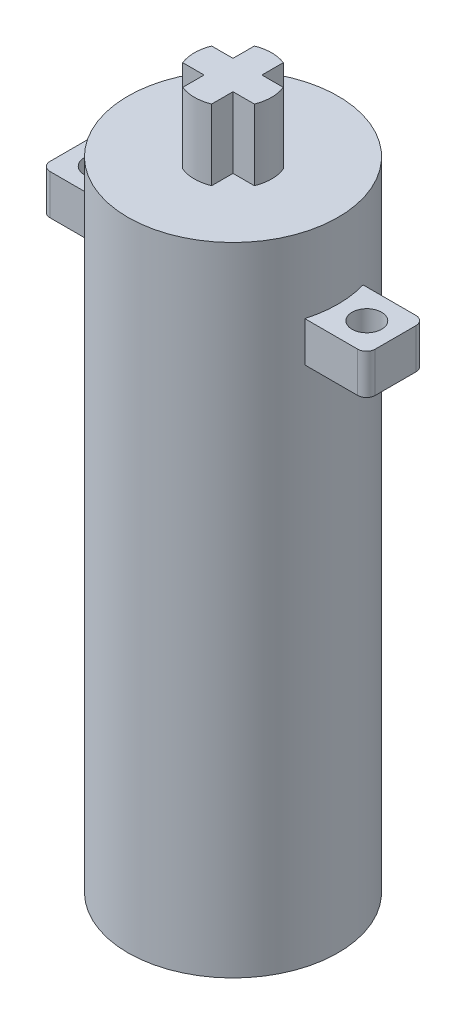
ISO-10303-21;
HEADER;
FILE_DESCRIPTION(('STEP AP214'),'2;1');
FILE_NAME('part.step','',(''),(''),'','','');
FILE_SCHEMA(('AUTOMOTIVE_DESIGN { 1 0 10303 214 1 1 1 1 }'));
ENDSEC;
DATA;
#1=APPLICATION_CONTEXT('core data for automotive mechanical design processes');
#2=APPLICATION_PROTOCOL_DEFINITION('international standard','automotive_design',2000,#1);
#3=PRODUCT_CONTEXT('',#1,'mechanical');
#4=PRODUCT('Part','Part','',(#3));
#5=PRODUCT_RELATED_PRODUCT_CATEGORY('part','',(#4));
#6=PRODUCT_DEFINITION_FORMATION('','',#4);
#7=PRODUCT_DEFINITION_CONTEXT('part definition',#1,'design');
#8=PRODUCT_DEFINITION('design','',#6,#7);
#9=PRODUCT_DEFINITION_SHAPE('','',#8);
#10=(LENGTH_UNIT() NAMED_UNIT(*) SI_UNIT(.MILLI.,.METRE.));
#11=(NAMED_UNIT(*) PLANE_ANGLE_UNIT() SI_UNIT($,.RADIAN.));
#12=(NAMED_UNIT(*) SI_UNIT($,.STERADIAN.) SOLID_ANGLE_UNIT());
#13=UNCERTAINTY_MEASURE_WITH_UNIT(LENGTH_MEASURE(1.E-05),#10,'distance_accuracy_value','');
#14=(GEOMETRIC_REPRESENTATION_CONTEXT(3) GLOBAL_UNCERTAINTY_ASSIGNED_CONTEXT((#13)) GLOBAL_UNIT_ASSIGNED_CONTEXT((#10,
#11,#12)) REPRESENTATION_CONTEXT('',''));
#15=CARTESIAN_POINT('',(0.,0.,0.));
#16=DIRECTION('',(0.,0.,1.));
#17=DIRECTION('',(1.,0.,0.));
#18=AXIS2_PLACEMENT_3D('',#15,#16,#17);
#19=CARTESIAN_POINT('',(0.,2.2900005,-1.6649954));
#20=DIRECTION('',(0.,0.,-1.));
#21=DIRECTION('',(-1.,0.,0.));
#22=AXIS2_PLACEMENT_3D('',#19,#20,#21);
#23=PLANE('',#22);
#24=DIRECTION('',(0.,1.,0.));
#25=VECTOR('',#24,1.);
#26=CARTESIAN_POINT('',(-5.76435588058018,-29.78994804,-1.6649954));
#27=LINE('',#26,#25);
#28=CARTESIAN_POINT('',(-5.76435588058018,0.,-1.6649954));
#29=VERTEX_POINT('',#28);
#30=CARTESIAN_POINT('',(-5.76435588058018,2.2900005,-1.6649954));
#31=VERTEX_POINT('',#30);
#32=EDGE_CURVE('E382',#29,#31,#27,.T.);
#33=ORIENTED_EDGE('',*,*,#32,.F.);
#34=DIRECTION('',(1.,0.,0.));
#35=VECTOR('',#34,1.);
#36=CARTESIAN_POINT('',(0.,0.,-1.6649954));
#37=LINE('',#36,#35);
#38=CARTESIAN_POINT('',(-8.7849954,0.,-1.6649954));
#39=VERTEX_POINT('',#38);
#40=EDGE_CURVE('E247',#39,#29,#37,.T.);
#41=ORIENTED_EDGE('',*,*,#40,.F.);
#42=DIRECTION('',(0.,-1.,0.));
#43=VECTOR('',#42,1.);
#44=CARTESIAN_POINT('',(-8.7849954,2.2900005,-1.6649954));
#45=LINE('',#44,#43);
#46=CARTESIAN_POINT('',(-8.7849954,2.2900005,-1.6649954));
#47=VERTEX_POINT('',#46);
#48=EDGE_CURVE('E221',#47,#39,#45,.T.);
#49=ORIENTED_EDGE('',*,*,#48,.F.);
#50=DIRECTION('',(1.,0.,0.));
#51=VECTOR('',#50,1.);
#52=CARTESIAN_POINT('',(0.,2.2900005,-1.6649954));
#53=LINE('',#52,#51);
#54=EDGE_CURVE('E235',#47,#31,#53,.T.);
#55=ORIENTED_EDGE('',*,*,#54,.T.);
#56=EDGE_LOOP('',(#33,#41,#49,#55));
#57=FACE_BOUND('',#56,.T.);
#58=ADVANCED_FACE('F35',(#57),#23,.T.);
#59=CARTESIAN_POINT('',(-8.7849954,2.2900005,-1.1649954));
#60=DIRECTION('',(0.,-1.,0.));
#61=DIRECTION('',(0.,0.,-1.));
#62=AXIS2_PLACEMENT_3D('',#59,#60,#61);
#63=CYLINDRICAL_SURFACE('',#62,0.5);
#64=CARTESIAN_POINT('',(-8.7849954,0.,-1.1649954));
#65=DIRECTION('',(0.,1.,0.));
#66=DIRECTION('',(0.,0.,1.));
#67=AXIS2_PLACEMENT_3D('',#64,#65,#66);
#68=CIRCLE('',#67,0.5);
#69=CARTESIAN_POINT('',(-9.2849954,0.,-1.1649954));
#70=VERTEX_POINT('',#69);
#71=EDGE_CURVE('E245',#39,#70,#68,.T.);
#72=ORIENTED_EDGE('',*,*,#71,.T.);
#73=DIRECTION('',(0.,-1.,0.));
#74=VECTOR('',#73,1.);
#75=CARTESIAN_POINT('',(-9.2849954,2.2900005,-1.1649954));
#76=LINE('',#75,#74);
#77=CARTESIAN_POINT('',(-9.2849954,2.2900005,-1.1649954));
#78=VERTEX_POINT('',#77);
#79=EDGE_CURVE('E222',#78,#70,#76,.T.);
#80=ORIENTED_EDGE('',*,*,#79,.F.);
#81=CARTESIAN_POINT('',(-8.7849954,2.2900005,-1.1649954));
#82=DIRECTION('',(0.,1.,0.));
#83=DIRECTION('',(0.,0.,1.));
#84=AXIS2_PLACEMENT_3D('',#81,#82,#83);
#85=CIRCLE('',#84,0.5);
#86=EDGE_CURVE('E261',#47,#78,#85,.T.);
#87=ORIENTED_EDGE('',*,*,#86,.F.);
#88=ORIENTED_EDGE('',*,*,#48,.T.);
#89=EDGE_LOOP('',(#72,#80,#87,#88));
#90=FACE_BOUND('',#89,.T.);
#91=ADVANCED_FACE('F413',(#90),#63,.T.);
#92=CARTESIAN_POINT('',(-9.2849954,2.2900005,0.));
#93=DIRECTION('',(1.,0.,0.));
#94=DIRECTION('',(0.,0.,-1.));
#95=AXIS2_PLACEMENT_3D('',#92,#93,#94);
#96=PLANE('',#95);
#97=DIRECTION('',(0.,0.,1.));
#98=VECTOR('',#97,1.);
#99=CARTESIAN_POINT('',(-9.2849954,0.,0.));
#100=LINE('',#99,#98);
#101=CARTESIAN_POINT('',(-9.2849954,0.,1.1649954));
#102=VERTEX_POINT('',#101);
#103=EDGE_CURVE('E242',#70,#102,#100,.T.);
#104=ORIENTED_EDGE('',*,*,#103,.T.);
#105=DIRECTION('',(0.,-1.,0.));
#106=VECTOR('',#105,1.);
#107=CARTESIAN_POINT('',(-9.2849954,2.2900005,1.1649954));
#108=LINE('',#107,#106);
#109=CARTESIAN_POINT('',(-9.2849954,2.2900005,1.1649954));
#110=VERTEX_POINT('',#109);
#111=EDGE_CURVE('E227',#110,#102,#108,.T.);
#112=ORIENTED_EDGE('',*,*,#111,.F.);
#113=DIRECTION('',(0.,0.,1.));
#114=VECTOR('',#113,1.);
#115=CARTESIAN_POINT('',(-9.2849954,2.2900005,0.));
#116=LINE('',#115,#114);
#117=EDGE_CURVE('E259',#78,#110,#116,.T.);
#118=ORIENTED_EDGE('',*,*,#117,.F.);
#119=ORIENTED_EDGE('',*,*,#79,.T.);
#120=EDGE_LOOP('',(#104,#112,#118,#119));
#121=FACE_BOUND('',#120,.T.);
#122=ADVANCED_FACE('F418',(#121),#96,.F.);
#123=CARTESIAN_POINT('',(-8.7849954,2.2900005,1.1649954));
#124=DIRECTION('',(0.,-1.,0.));
#125=DIRECTION('',(0.,0.,-1.));
#126=AXIS2_PLACEMENT_3D('',#123,#124,#125);
#127=CYLINDRICAL_SURFACE('',#126,0.5);
#128=CARTESIAN_POINT('',(-8.7849954,0.,1.1649954));
#129=DIRECTION('',(0.,1.,0.));
#130=DIRECTION('',(0.,0.,1.));
#131=AXIS2_PLACEMENT_3D('',#128,#129,#130);
#132=CIRCLE('',#131,0.5);
#133=CARTESIAN_POINT('',(-8.7849954,0.,1.6649954));
#134=VERTEX_POINT('',#133);
#135=EDGE_CURVE('E239',#134,#102,#132,.F.);
#136=ORIENTED_EDGE('',*,*,#135,.F.);
#137=DIRECTION('',(0.,-1.,0.));
#138=VECTOR('',#137,1.);
#139=CARTESIAN_POINT('',(-8.7849954,2.2900005,1.6649954));
#140=LINE('',#139,#138);
#141=CARTESIAN_POINT('',(-8.7849954,2.2900005,1.6649954));
#142=VERTEX_POINT('',#141);
#143=EDGE_CURVE('E229',#142,#134,#140,.T.);
#144=ORIENTED_EDGE('',*,*,#143,.F.);
#145=CARTESIAN_POINT('',(-8.7849954,2.2900005,1.1649954));
#146=DIRECTION('',(0.,1.,0.));
#147=DIRECTION('',(0.,0.,1.));
#148=AXIS2_PLACEMENT_3D('',#145,#146,#147);
#149=CIRCLE('',#148,0.5);
#150=EDGE_CURVE('E256',#142,#110,#149,.F.);
#151=ORIENTED_EDGE('',*,*,#150,.T.);
#152=ORIENTED_EDGE('',*,*,#111,.T.);
#153=EDGE_LOOP('',(#136,#144,#151,#152));
#154=FACE_BOUND('',#153,.T.);
#155=ADVANCED_FACE('F443',(#154),#127,.T.);
#156=CARTESIAN_POINT('',(0.,2.2900005,1.6649954));
#157=DIRECTION('',(0.,0.,-1.));
#158=DIRECTION('',(-1.,0.,0.));
#159=AXIS2_PLACEMENT_3D('',#156,#157,#158);
#160=PLANE('',#159);
#161=DIRECTION('',(1.,0.,0.));
#162=VECTOR('',#161,1.);
#163=CARTESIAN_POINT('',(0.,0.,1.6649954));
#164=LINE('',#163,#162);
#165=CARTESIAN_POINT('',(-5.76435588058018,0.,1.6649954));
#166=VERTEX_POINT('',#165);
#167=EDGE_CURVE('E236',#134,#166,#164,.T.);
#168=ORIENTED_EDGE('',*,*,#167,.T.);
#169=DIRECTION('',(0.,1.,0.));
#170=VECTOR('',#169,1.);
#171=CARTESIAN_POINT('',(-5.76435588058018,-29.78994804,1.6649954));
#172=LINE('',#171,#170);
#173=CARTESIAN_POINT('',(-5.76435588058018,2.2900005,1.6649954));
#174=VERTEX_POINT('',#173);
#175=EDGE_CURVE('E49',#166,#174,#172,.T.);
#176=ORIENTED_EDGE('',*,*,#175,.T.);
#177=DIRECTION('',(1.,0.,0.));
#178=VECTOR('',#177,1.);
#179=CARTESIAN_POINT('',(0.,2.2900005,1.6649954));
#180=LINE('',#179,#178);
#181=EDGE_CURVE('E253',#142,#174,#180,.T.);
#182=ORIENTED_EDGE('',*,*,#181,.F.);
#183=ORIENTED_EDGE('',*,*,#143,.T.);
#184=EDGE_LOOP('',(#168,#176,#182,#183));
#185=FACE_BOUND('',#184,.T.);
#186=ADVANCED_FACE('F440',(#185),#160,.F.);
#187=CARTESIAN_POINT('',(-7.64249678,2.2900005,0.));
#188=DIRECTION('',(0.,-1.,0.));
#189=DIRECTION('',(0.,0.,-1.));
#190=AXIS2_PLACEMENT_3D('',#187,#188,#189);
#191=CYLINDRICAL_SURFACE('',#190,0.844994499999998);
#192=CARTESIAN_POINT('',(-7.64249678,2.2900005,0.));
#193=DIRECTION('',(0.,1.,0.));
#194=DIRECTION('',(0.,0.,1.));
#195=AXIS2_PLACEMENT_3D('',#192,#193,#194);
#196=CIRCLE('',#195,0.844994499999998);
#197=CARTESIAN_POINT('',(-7.64249678,2.2900005,0.844994499999999));
#198=VERTEX_POINT('',#197);
#199=EDGE_CURVE('E231',#198,#198,#196,.F.);
#200=ORIENTED_EDGE('',*,*,#199,.F.);
#201=EDGE_LOOP('',(#200));
#202=FACE_BOUND('',#201,.T.);
#203=CARTESIAN_POINT('',(-7.64249678,0.,0.));
#204=DIRECTION('',(0.,1.,0.));
#205=DIRECTION('',(0.,0.,1.));
#206=AXIS2_PLACEMENT_3D('',#203,#204,#205);
#207=CIRCLE('',#206,0.844994499999998);
#208=CARTESIAN_POINT('',(-7.64249678,0.,0.844994499999999));
#209=VERTEX_POINT('',#208);
#210=EDGE_CURVE('E232',#209,#209,#207,.F.);
#211=ORIENTED_EDGE('',*,*,#210,.T.);
#212=EDGE_LOOP('',(#211));
#213=FACE_BOUND('',#212,.T.);
#214=ADVANCED_FACE('F450',(#202,#213),#191,.F.);
#215=CARTESIAN_POINT('',(0.,2.2900005,0.));
#216=DIRECTION('',(0.,1.,0.));
#217=DIRECTION('',(0.,0.,1.));
#218=AXIS2_PLACEMENT_3D('',#215,#216,#217);
#219=PLANE('',#218);
#220=CARTESIAN_POINT('',(0.,2.2900005,0.));
#221=DIRECTION('',(0.,1.,0.));
#222=DIRECTION('',(0.,0.,1.));
#223=AXIS2_PLACEMENT_3D('',#220,#221,#222);
#224=CIRCLE('',#223,6.0000007);
#225=EDGE_CURVE('E380',#31,#174,#224,.T.);
#226=ORIENTED_EDGE('',*,*,#225,.F.);
#227=ORIENTED_EDGE('',*,*,#54,.F.);
#228=ORIENTED_EDGE('',*,*,#86,.T.);
#229=ORIENTED_EDGE('',*,*,#117,.T.);
#230=ORIENTED_EDGE('',*,*,#150,.F.);
#231=ORIENTED_EDGE('',*,*,#181,.T.);
#232=EDGE_LOOP('',(#226,#227,#228,#229,#230,#231));
#233=FACE_BOUND('',#232,.T.);
#234=ORIENTED_EDGE('',*,*,#199,.T.);
#235=EDGE_LOOP('',(#234));
#236=FACE_BOUND('',#235,.T.);
#237=ADVANCED_FACE('F436',(#233,#236),#219,.T.);
#238=CARTESIAN_POINT('',(0.,0.,0.));
#239=DIRECTION('',(0.,1.,0.));
#240=DIRECTION('',(0.,0.,1.));
#241=AXIS2_PLACEMENT_3D('',#238,#239,#240);
#242=PLANE('',#241);
#243=ORIENTED_EDGE('',*,*,#40,.T.);
#244=CARTESIAN_POINT('',(0.,0.,0.));
#245=DIRECTION('',(0.,1.,0.));
#246=DIRECTION('',(0.,0.,1.));
#247=AXIS2_PLACEMENT_3D('',#244,#245,#246);
#248=CIRCLE('',#247,6.0000007);
#249=EDGE_CURVE('E385',#29,#166,#248,.T.);
#250=ORIENTED_EDGE('',*,*,#249,.T.);
#251=ORIENTED_EDGE('',*,*,#167,.F.);
#252=ORIENTED_EDGE('',*,*,#135,.T.);
#253=ORIENTED_EDGE('',*,*,#103,.F.);
#254=ORIENTED_EDGE('',*,*,#71,.F.);
#255=EDGE_LOOP('',(#243,#250,#251,#252,#253,#254));
#256=FACE_BOUND('',#255,.T.);
#257=ORIENTED_EDGE('',*,*,#210,.F.);
#258=EDGE_LOOP('',(#257));
#259=FACE_BOUND('',#258,.T.);
#260=ADVANCED_FACE('F400',(#256,#259),#242,.F.);
#261=CARTESIAN_POINT('',(0.,-29.78994804,0.));
#262=DIRECTION('',(0.,1.,0.));
#263=DIRECTION('',(0.,0.,1.));
#264=AXIS2_PLACEMENT_3D('',#261,#262,#263);
#265=CYLINDRICAL_SURFACE('',#264,6.0000007);
#266=ORIENTED_EDGE('',*,*,#32,.T.);
#267=ORIENTED_EDGE('',*,*,#225,.T.);
#268=ORIENTED_EDGE('',*,*,#175,.F.);
#269=ORIENTED_EDGE('',*,*,#249,.F.);
#270=EDGE_LOOP('',(#266,#267,#268,#269));
#271=FACE_BOUND('',#270,.T.);
#272=CARTESIAN_POINT('',(0.,6.579997,0.));
#273=DIRECTION('',(0.,1.,0.));
#274=DIRECTION('',(0.,0.,1.));
#275=AXIS2_PLACEMENT_3D('',#272,#273,#274);
#276=CIRCLE('',#275,6.0000007);
#277=CARTESIAN_POINT('',(0.,6.579997,6.0000007));
#278=VERTEX_POINT('',#277);
#279=EDGE_CURVE('E391',#278,#278,#276,.T.);
#280=ORIENTED_EDGE('',*,*,#279,.F.);
#281=EDGE_LOOP('',(#280));
#282=FACE_BOUND('',#281,.T.);
#283=CARTESIAN_POINT('',(0.,-29.78994804,0.));
#284=DIRECTION('',(0.,1.,0.));
#285=DIRECTION('',(0.,0.,1.));
#286=AXIS2_PLACEMENT_3D('',#283,#284,#285);
#287=CIRCLE('',#286,6.0000007);
#288=CARTESIAN_POINT('',(0.,-29.78994804,6.0000007));
#289=VERTEX_POINT('',#288);
#290=EDGE_CURVE('E217',#289,#289,#287,.T.);
#291=ORIENTED_EDGE('',*,*,#290,.T.);
#292=EDGE_LOOP('',(#291));
#293=FACE_BOUND('',#292,.T.);
#294=CARTESIAN_POINT('',(5.76435588058018,0.,1.6649954));
#295=VERTEX_POINT('',#294);
#296=CARTESIAN_POINT('',(5.76435588058018,0.,-1.6649954));
#297=VERTEX_POINT('',#296);
#298=EDGE_CURVE('E386',#295,#297,#248,.T.);
#299=ORIENTED_EDGE('',*,*,#298,.F.);
#300=DIRECTION('',(0.,1.,0.));
#301=VECTOR('',#300,1.);
#302=CARTESIAN_POINT('',(5.76435588058018,-29.78994804,1.6649954));
#303=LINE('',#302,#301);
#304=CARTESIAN_POINT('',(5.76435588058018,2.2900005,1.6649954));
#305=VERTEX_POINT('',#304);
#306=EDGE_CURVE('E216',#305,#295,#303,.F.);
#307=ORIENTED_EDGE('',*,*,#306,.F.);
#308=CARTESIAN_POINT('',(0.,2.2900005,0.));
#309=DIRECTION('',(0.,1.,0.));
#310=DIRECTION('',(0.,0.,1.));
#311=AXIS2_PLACEMENT_3D('',#308,#309,#310);
#312=CIRCLE('',#311,6.0000007);
#313=CARTESIAN_POINT('',(5.76435588058018,2.2900005,-1.6649954));
#314=VERTEX_POINT('',#313);
#315=EDGE_CURVE('E42',#305,#314,#312,.T.);
#316=ORIENTED_EDGE('',*,*,#315,.T.);
#317=DIRECTION('',(0.,1.,0.));
#318=VECTOR('',#317,1.);
#319=CARTESIAN_POINT('',(5.76435588058018,-29.78994804,-1.6649954));
#320=LINE('',#319,#318);
#321=EDGE_CURVE('E211',#314,#297,#320,.F.);
#322=ORIENTED_EDGE('',*,*,#321,.T.);
#323=EDGE_LOOP('',(#299,#307,#316,#322));
#324=FACE_BOUND('',#323,.T.);
#325=ADVANCED_FACE('F220',(#271,#282,#293,#324),#265,.T.);
#326=CARTESIAN_POINT('',(0.,-29.78994804,0.));
#327=DIRECTION('',(0.,1.,0.));
#328=DIRECTION('',(0.,0.,1.));
#329=AXIS2_PLACEMENT_3D('',#326,#327,#328);
#330=PLANE('',#329);
#331=ORIENTED_EDGE('',*,*,#290,.F.);
#332=EDGE_LOOP('',(#331));
#333=FACE_BOUND('',#332,.T.);
#334=ADVANCED_FACE('F399',(#333),#330,.F.);
#335=CARTESIAN_POINT('',(0.,6.579997,0.));
#336=DIRECTION('',(0.,1.,0.));
#337=DIRECTION('',(0.,0.,1.));
#338=AXIS2_PLACEMENT_3D('',#335,#336,#337);
#339=PLANE('',#338);
#340=CARTESIAN_POINT('',(0.,6.579997,0.));
#341=DIRECTION('',(0.,1.,0.));
#342=DIRECTION('',(0.,0.,1.));
#343=AXIS2_PLACEMENT_3D('',#340,#341,#342);
#344=CIRCLE('',#343,2.2049994);
#345=CARTESIAN_POINT('',(2.04489067858469,6.579997,0.824890578584694));
#346=VERTEX_POINT('',#345);
#347=CARTESIAN_POINT('',(2.04489067858469,6.579997,-0.824890578584694));
#348=VERTEX_POINT('',#347);
#349=EDGE_CURVE('E359',#346,#348,#344,.T.);
#350=ORIENTED_EDGE('',*,*,#349,.F.);
#351=DIRECTION('',(-1.,0.,0.));
#352=VECTOR('',#351,1.);
#353=CARTESIAN_POINT('',(0.,6.579997,0.824890578584694));
#354=LINE('',#353,#352);
#355=CARTESIAN_POINT('',(0.824890578584694,6.579997,0.824890578584694));
#356=VERTEX_POINT('',#355);
#357=EDGE_CURVE('E57',#346,#356,#354,.T.);
#358=ORIENTED_EDGE('',*,*,#357,.T.);
#359=DIRECTION('',(0.,0.,1.));
#360=VECTOR('',#359,1.);
#361=CARTESIAN_POINT('',(0.824890578584694,6.579997,0.));
#362=LINE('',#361,#360);
#363=CARTESIAN_POINT('',(0.824890578584694,6.579997,2.04489067858469));
#364=VERTEX_POINT('',#363);
#365=EDGE_CURVE('E11',#356,#364,#362,.T.);
#366=ORIENTED_EDGE('',*,*,#365,.T.);
#367=CARTESIAN_POINT('',(0.,6.579997,0.));
#368=DIRECTION('',(0.,1.,0.));
#369=DIRECTION('',(0.,0.,1.));
#370=AXIS2_PLACEMENT_3D('',#367,#368,#369);
#371=CIRCLE('',#370,2.2049994);
#372=CARTESIAN_POINT('',(-0.824890578584694,6.579997,2.04489067858469));
#373=VERTEX_POINT('',#372);
#374=EDGE_CURVE('E377',#373,#364,#371,.T.);
#375=ORIENTED_EDGE('',*,*,#374,.F.);
#376=DIRECTION('',(0.,0.,1.));
#377=VECTOR('',#376,1.);
#378=CARTESIAN_POINT('',(-0.824890578584694,6.579997,0.));
#379=LINE('',#378,#377);
#380=CARTESIAN_POINT('',(-0.824890578584694,6.579997,0.824890578584694));
#381=VERTEX_POINT('',#380);
#382=EDGE_CURVE('E375',#381,#373,#379,.T.);
#383=ORIENTED_EDGE('',*,*,#382,.F.);
#384=DIRECTION('',(1.,0.,0.));
#385=VECTOR('',#384,1.);
#386=CARTESIAN_POINT('',(0.,6.579997,0.824890578584694));
#387=LINE('',#386,#385);
#388=CARTESIAN_POINT('',(-2.04489067858469,6.579997,0.824890578584694));
#389=VERTEX_POINT('',#388);
#390=EDGE_CURVE('E373',#389,#381,#387,.T.);
#391=ORIENTED_EDGE('',*,*,#390,.F.);
#392=CARTESIAN_POINT('',(0.,6.579997,0.));
#393=DIRECTION('',(0.,1.,0.));
#394=DIRECTION('',(0.,0.,1.));
#395=AXIS2_PLACEMENT_3D('',#392,#393,#394);
#396=CIRCLE('',#395,2.2049994);
#397=CARTESIAN_POINT('',(-2.04489067858469,6.579997,-0.824890578584694));
#398=VERTEX_POINT('',#397);
#399=EDGE_CURVE('E371',#398,#389,#396,.T.);
#400=ORIENTED_EDGE('',*,*,#399,.F.);
#401=DIRECTION('',(-1.,0.,0.));
#402=VECTOR('',#401,1.);
#403=CARTESIAN_POINT('',(0.,6.579997,-0.824890578584694));
#404=LINE('',#403,#402);
#405=CARTESIAN_POINT('',(-0.824890578584694,6.579997,-0.824890578584694));
#406=VERTEX_POINT('',#405);
#407=EDGE_CURVE('E369',#406,#398,#404,.T.);
#408=ORIENTED_EDGE('',*,*,#407,.F.);
#409=DIRECTION('',(0.,0.,1.));
#410=VECTOR('',#409,1.);
#411=CARTESIAN_POINT('',(-0.824890578584694,6.579997,0.));
#412=LINE('',#411,#410);
#413=CARTESIAN_POINT('',(-0.824890578584694,6.579997,-2.04489067858469));
#414=VERTEX_POINT('',#413);
#415=EDGE_CURVE('E367',#414,#406,#412,.T.);
#416=ORIENTED_EDGE('',*,*,#415,.F.);
#417=CARTESIAN_POINT('',(0.,6.579997,0.));
#418=DIRECTION('',(0.,1.,0.));
#419=DIRECTION('',(0.,0.,1.));
#420=AXIS2_PLACEMENT_3D('',#417,#418,#419);
#421=CIRCLE('',#420,2.2049994);
#422=CARTESIAN_POINT('',(0.824890578584694,6.579997,-2.04489067858469));
#423=VERTEX_POINT('',#422);
#424=EDGE_CURVE('E365',#423,#414,#421,.T.);
#425=ORIENTED_EDGE('',*,*,#424,.F.);
#426=DIRECTION('',(0.,0.,-1.));
#427=VECTOR('',#426,1.);
#428=CARTESIAN_POINT('',(0.824890578584694,6.579997,0.));
#429=LINE('',#428,#427);
#430=CARTESIAN_POINT('',(0.824890578584694,6.579997,-0.824890578584694));
#431=VERTEX_POINT('',#430);
#432=EDGE_CURVE('E363',#431,#423,#429,.T.);
#433=ORIENTED_EDGE('',*,*,#432,.F.);
#434=DIRECTION('',(-1.,0.,0.));
#435=VECTOR('',#434,1.);
#436=CARTESIAN_POINT('',(0.,6.579997,-0.824890578584693));
#437=LINE('',#436,#435);
#438=EDGE_CURVE('E361',#348,#431,#437,.T.);
#439=ORIENTED_EDGE('',*,*,#438,.F.);
#440=EDGE_LOOP('',(#350,#358,#366,#375,#383,#391,#400,#408,#416,#425,#433,#439));
#441=FACE_BOUND('',#440,.T.);
#442=ORIENTED_EDGE('',*,*,#279,.T.);
#443=EDGE_LOOP('',(#442));
#444=FACE_BOUND('',#443,.T.);
#445=ADVANCED_FACE('F395',(#441,#444),#339,.T.);
#446=CARTESIAN_POINT('',(7.64249678,2.2900005,0.));
#447=DIRECTION('',(0.,-1.,0.));
#448=DIRECTION('',(0.,0.,-1.));
#449=AXIS2_PLACEMENT_3D('',#446,#447,#448);
#450=CYLINDRICAL_SURFACE('',#449,0.844994499999998);
#451=CARTESIAN_POINT('',(7.64249678,2.2900005,0.));
#452=DIRECTION('',(0.,1.,0.));
#453=DIRECTION('',(0.,0.,1.));
#454=AXIS2_PLACEMENT_3D('',#451,#452,#453);
#455=CIRCLE('',#454,0.844994499999998);
#456=CARTESIAN_POINT('',(7.64249678,2.2900005,0.844994499999999));
#457=VERTEX_POINT('',#456);
#458=EDGE_CURVE('E207',#457,#457,#455,.T.);
#459=ORIENTED_EDGE('',*,*,#458,.T.);
#460=EDGE_LOOP('',(#459));
#461=FACE_BOUND('',#460,.T.);
#462=CARTESIAN_POINT('',(7.64249678,0.,0.));
#463=DIRECTION('',(0.,1.,0.));
#464=DIRECTION('',(0.,0.,1.));
#465=AXIS2_PLACEMENT_3D('',#462,#463,#464);
#466=CIRCLE('',#465,0.844994499999998);
#467=CARTESIAN_POINT('',(7.64249678,0.,0.844994499999999));
#468=VERTEX_POINT('',#467);
#469=EDGE_CURVE('E332',#468,#468,#466,.T.);
#470=ORIENTED_EDGE('',*,*,#469,.F.);
#471=EDGE_LOOP('',(#470));
#472=FACE_BOUND('',#471,.T.);
#473=ADVANCED_FACE('F409',(#461,#472),#450,.F.);
#474=CARTESIAN_POINT('',(8.7849954,2.2900005,-1.1649954));
#475=DIRECTION('',(0.,-1.,0.));
#476=DIRECTION('',(0.,0.,-1.));
#477=AXIS2_PLACEMENT_3D('',#474,#475,#476);
#478=CYLINDRICAL_SURFACE('',#477,0.5);
#479=CARTESIAN_POINT('',(8.7849954,0.,-1.1649954));
#480=DIRECTION('',(0.,1.,0.));
#481=DIRECTION('',(0.,0.,1.));
#482=AXIS2_PLACEMENT_3D('',#479,#480,#481);
#483=CIRCLE('',#482,0.5);
#484=CARTESIAN_POINT('',(9.2849954,0.,-1.1649954));
#485=VERTEX_POINT('',#484);
#486=CARTESIAN_POINT('',(8.7849954,0.,-1.6649954));
#487=VERTEX_POINT('',#486);
#488=EDGE_CURVE('E337',#485,#487,#483,.T.);
#489=ORIENTED_EDGE('',*,*,#488,.T.);
#490=DIRECTION('',(0.,-1.,0.));
#491=VECTOR('',#490,1.);
#492=CARTESIAN_POINT('',(8.7849954,2.2900005,-1.6649954));
#493=LINE('',#492,#491);
#494=CARTESIAN_POINT('',(8.7849954,2.2900005,-1.6649954));
#495=VERTEX_POINT('',#494);
#496=EDGE_CURVE('E330',#495,#487,#493,.T.);
#497=ORIENTED_EDGE('',*,*,#496,.F.);
#498=CARTESIAN_POINT('',(8.7849954,2.2900005,-1.1649954));
#499=DIRECTION('',(0.,1.,0.));
#500=DIRECTION('',(0.,0.,1.));
#501=AXIS2_PLACEMENT_3D('',#498,#499,#500);
#502=CIRCLE('',#501,0.5);
#503=CARTESIAN_POINT('',(9.2849954,2.2900005,-1.1649954));
#504=VERTEX_POINT('',#503);
#505=EDGE_CURVE('E203',#504,#495,#502,.T.);
#506=ORIENTED_EDGE('',*,*,#505,.F.);
#507=DIRECTION('',(0.,-1.,0.));
#508=VECTOR('',#507,1.);
#509=CARTESIAN_POINT('',(9.2849954,2.2900005,-1.1649954));
#510=LINE('',#509,#508);
#511=EDGE_CURVE('E328',#504,#485,#510,.T.);
#512=ORIENTED_EDGE('',*,*,#511,.T.);
#513=EDGE_LOOP('',(#489,#497,#506,#512));
#514=FACE_BOUND('',#513,.T.);
#515=ADVANCED_FACE('F524',(#514),#478,.T.);
#516=CARTESIAN_POINT('',(9.2849954,2.2900005,0.));
#517=DIRECTION('',(1.,0.,0.));
#518=DIRECTION('',(0.,0.,-1.));
#519=AXIS2_PLACEMENT_3D('',#516,#517,#518);
#520=PLANE('',#519);
#521=DIRECTION('',(0.,0.,1.));
#522=VECTOR('',#521,1.);
#523=CARTESIAN_POINT('',(9.2849954,0.,0.));
#524=LINE('',#523,#522);
#525=CARTESIAN_POINT('',(9.2849954,0.,1.1649954));
#526=VERTEX_POINT('',#525);
#527=EDGE_CURVE('E340',#485,#526,#524,.T.);
#528=ORIENTED_EDGE('',*,*,#527,.F.);
#529=ORIENTED_EDGE('',*,*,#511,.F.);
#530=DIRECTION('',(0.,0.,1.));
#531=VECTOR('',#530,1.);
#532=CARTESIAN_POINT('',(9.2849954,2.2900005,0.));
#533=LINE('',#532,#531);
#534=CARTESIAN_POINT('',(9.2849954,2.2900005,1.1649954));
#535=VERTEX_POINT('',#534);
#536=EDGE_CURVE('E351',#504,#535,#533,.T.);
#537=ORIENTED_EDGE('',*,*,#536,.T.);
#538=DIRECTION('',(0.,-1.,0.));
#539=VECTOR('',#538,1.);
#540=CARTESIAN_POINT('',(9.2849954,2.2900005,1.1649954));
#541=LINE('',#540,#539);
#542=EDGE_CURVE('E326',#535,#526,#541,.T.);
#543=ORIENTED_EDGE('',*,*,#542,.T.);
#544=EDGE_LOOP('',(#528,#529,#537,#543));
#545=FACE_BOUND('',#544,.T.);
#546=ADVANCED_FACE('F520',(#545),#520,.T.);
#547=CARTESIAN_POINT('',(8.7849954,2.2900005,1.1649954));
#548=DIRECTION('',(0.,-1.,0.));
#549=DIRECTION('',(0.,0.,-1.));
#550=AXIS2_PLACEMENT_3D('',#547,#548,#549);
#551=CYLINDRICAL_SURFACE('',#550,0.5);
#552=CARTESIAN_POINT('',(8.7849954,0.,1.1649954));
#553=DIRECTION('',(0.,1.,0.));
#554=DIRECTION('',(0.,0.,1.));
#555=AXIS2_PLACEMENT_3D('',#552,#553,#554);
#556=CIRCLE('',#555,0.5);
#557=CARTESIAN_POINT('',(8.7849954,0.,1.6649954));
#558=VERTEX_POINT('',#557);
#559=EDGE_CURVE('E343',#526,#558,#556,.F.);
#560=ORIENTED_EDGE('',*,*,#559,.F.);
#561=ORIENTED_EDGE('',*,*,#542,.F.);
#562=CARTESIAN_POINT('',(8.7849954,2.2900005,1.1649954));
#563=DIRECTION('',(0.,1.,0.));
#564=DIRECTION('',(0.,0.,1.));
#565=AXIS2_PLACEMENT_3D('',#562,#563,#564);
#566=CIRCLE('',#565,0.5);
#567=CARTESIAN_POINT('',(8.7849954,2.2900005,1.6649954));
#568=VERTEX_POINT('',#567);
#569=EDGE_CURVE('E354',#535,#568,#566,.F.);
#570=ORIENTED_EDGE('',*,*,#569,.T.);
#571=DIRECTION('',(0.,-1.,0.));
#572=VECTOR('',#571,1.);
#573=CARTESIAN_POINT('',(8.7849954,2.2900005,1.6649954));
#574=LINE('',#573,#572);
#575=EDGE_CURVE('E323',#568,#558,#574,.T.);
#576=ORIENTED_EDGE('',*,*,#575,.T.);
#577=EDGE_LOOP('',(#560,#561,#570,#576));
#578=FACE_BOUND('',#577,.T.);
#579=ADVANCED_FACE('F517',(#578),#551,.T.);
#580=CARTESIAN_POINT('',(0.,2.2900005,0.));
#581=DIRECTION('',(0.,1.,0.));
#582=DIRECTION('',(0.,0.,1.));
#583=AXIS2_PLACEMENT_3D('',#580,#581,#582);
#584=PLANE('',#583);
#585=ORIENTED_EDGE('',*,*,#315,.F.);
#586=DIRECTION('',(1.,0.,0.));
#587=VECTOR('',#586,1.);
#588=CARTESIAN_POINT('',(0.,2.2900005,1.6649954));
#589=LINE('',#588,#587);
#590=EDGE_CURVE('E335',#305,#568,#589,.T.);
#591=ORIENTED_EDGE('',*,*,#590,.T.);
#592=ORIENTED_EDGE('',*,*,#569,.F.);
#593=ORIENTED_EDGE('',*,*,#536,.F.);
#594=ORIENTED_EDGE('',*,*,#505,.T.);
#595=DIRECTION('',(1.,0.,0.));
#596=VECTOR('',#595,1.);
#597=CARTESIAN_POINT('',(0.,2.2900005,-1.6649954));
#598=LINE('',#597,#596);
#599=EDGE_CURVE('E195',#314,#495,#598,.T.);
#600=ORIENTED_EDGE('',*,*,#599,.F.);
#601=EDGE_LOOP('',(#585,#591,#592,#593,#594,#600));
#602=FACE_BOUND('',#601,.T.);
#603=ORIENTED_EDGE('',*,*,#458,.F.);
#604=EDGE_LOOP('',(#603));
#605=FACE_BOUND('',#604,.T.);
#606=ADVANCED_FACE('F197',(#602,#605),#584,.T.);
#607=CARTESIAN_POINT('',(0.,2.2900005,-1.6649954));
#608=DIRECTION('',(0.,0.,-1.));
#609=DIRECTION('',(-1.,0.,0.));
#610=AXIS2_PLACEMENT_3D('',#607,#608,#609);
#611=PLANE('',#610);
#612=ORIENTED_EDGE('',*,*,#321,.F.);
#613=ORIENTED_EDGE('',*,*,#599,.T.);
#614=ORIENTED_EDGE('',*,*,#496,.T.);
#615=DIRECTION('',(1.,0.,0.));
#616=VECTOR('',#615,1.);
#617=CARTESIAN_POINT('',(0.,0.,-1.6649954));
#618=LINE('',#617,#616);
#619=EDGE_CURVE('E213',#297,#487,#618,.T.);
#620=ORIENTED_EDGE('',*,*,#619,.F.);
#621=EDGE_LOOP('',(#612,#613,#614,#620));
#622=FACE_BOUND('',#621,.T.);
#623=ADVANCED_FACE('F212',(#622),#611,.T.);
#624=CARTESIAN_POINT('',(0.,2.2900005,1.6649954));
#625=DIRECTION('',(0.,0.,-1.));
#626=DIRECTION('',(-1.,0.,0.));
#627=AXIS2_PLACEMENT_3D('',#624,#625,#626);
#628=PLANE('',#627);
#629=ORIENTED_EDGE('',*,*,#590,.F.);
#630=ORIENTED_EDGE('',*,*,#306,.T.);
#631=DIRECTION('',(1.,0.,0.));
#632=VECTOR('',#631,1.);
#633=CARTESIAN_POINT('',(0.,0.,1.6649954));
#634=LINE('',#633,#632);
#635=EDGE_CURVE('E346',#295,#558,#634,.T.);
#636=ORIENTED_EDGE('',*,*,#635,.T.);
#637=ORIENTED_EDGE('',*,*,#575,.F.);
#638=EDGE_LOOP('',(#629,#630,#636,#637));
#639=FACE_BOUND('',#638,.T.);
#640=ADVANCED_FACE('F513',(#639),#628,.F.);
#641=ORIENTED_EDGE('',*,*,#469,.T.);
#642=EDGE_LOOP('',(#641));
#643=FACE_BOUND('',#642,.T.);
#644=ORIENTED_EDGE('',*,*,#635,.F.);
#645=ORIENTED_EDGE('',*,*,#298,.T.);
#646=ORIENTED_EDGE('',*,*,#619,.T.);
#647=ORIENTED_EDGE('',*,*,#488,.F.);
#648=ORIENTED_EDGE('',*,*,#527,.T.);
#649=ORIENTED_EDGE('',*,*,#559,.T.);
#650=EDGE_LOOP('',(#644,#645,#646,#647,#648,#649));
#651=FACE_BOUND('',#650,.T.);
#652=ADVANCED_FACE('F459',(#643,#651),#242,.F.);
#653=CARTESIAN_POINT('',(0.,10.619994,0.));
#654=DIRECTION('',(0.,1.,0.));
#655=DIRECTION('',(0.,0.,1.));
#656=AXIS2_PLACEMENT_3D('',#653,#654,#655);
#657=PLANE('',#656);
#658=DIRECTION('',(-1.,0.,0.));
#659=VECTOR('',#658,1.);
#660=CARTESIAN_POINT('',(0.,10.619994,0.824890578584694));
#661=LINE('',#660,#659);
#662=CARTESIAN_POINT('',(2.04489067858469,10.619994,0.824890578584694));
#663=VERTEX_POINT('',#662);
#664=CARTESIAN_POINT('',(0.824890578584694,10.619994,0.824890578584694));
#665=VERTEX_POINT('',#664);
#666=EDGE_CURVE('E320',#663,#665,#661,.T.);
#667=ORIENTED_EDGE('',*,*,#666,.F.);
#668=CARTESIAN_POINT('',(0.,10.619994,0.));
#669=DIRECTION('',(0.,1.,0.));
#670=DIRECTION('',(0.,0.,1.));
#671=AXIS2_PLACEMENT_3D('',#668,#669,#670);
#672=CIRCLE('',#671,2.2049994);
#673=CARTESIAN_POINT('',(2.04489067858469,10.619994,-0.824890578584694));
#674=VERTEX_POINT('',#673);
#675=EDGE_CURVE('E318',#663,#674,#672,.T.);
#676=ORIENTED_EDGE('',*,*,#675,.T.);
#677=DIRECTION('',(-1.,0.,0.));
#678=VECTOR('',#677,1.);
#679=CARTESIAN_POINT('',(0.,10.619994,-0.824890578584693));
#680=LINE('',#679,#678);
#681=CARTESIAN_POINT('',(0.824890578584694,10.619994,-0.824890578584694));
#682=VERTEX_POINT('',#681);
#683=EDGE_CURVE('E316',#674,#682,#680,.T.);
#684=ORIENTED_EDGE('',*,*,#683,.T.);
#685=DIRECTION('',(0.,0.,-1.));
#686=VECTOR('',#685,1.);
#687=CARTESIAN_POINT('',(0.824890578584694,10.619994,0.));
#688=LINE('',#687,#686);
#689=CARTESIAN_POINT('',(0.824890578584694,10.619994,-2.04489067858469));
#690=VERTEX_POINT('',#689);
#691=EDGE_CURVE('E314',#682,#690,#688,.T.);
#692=ORIENTED_EDGE('',*,*,#691,.T.);
#693=CARTESIAN_POINT('',(0.,10.619994,0.));
#694=DIRECTION('',(0.,1.,0.));
#695=DIRECTION('',(0.,0.,1.));
#696=AXIS2_PLACEMENT_3D('',#693,#694,#695);
#697=CIRCLE('',#696,2.2049994);
#698=CARTESIAN_POINT('',(-0.824890578584694,10.619994,-2.04489067858469));
#699=VERTEX_POINT('',#698);
#700=EDGE_CURVE('E312',#690,#699,#697,.T.);
#701=ORIENTED_EDGE('',*,*,#700,.T.);
#702=DIRECTION('',(0.,0.,1.));
#703=VECTOR('',#702,1.);
#704=CARTESIAN_POINT('',(-0.824890578584694,10.619994,0.));
#705=LINE('',#704,#703);
#706=CARTESIAN_POINT('',(-0.824890578584694,10.619994,-0.824890578584694));
#707=VERTEX_POINT('',#706);
#708=EDGE_CURVE('E310',#699,#707,#705,.T.);
#709=ORIENTED_EDGE('',*,*,#708,.T.);
#710=DIRECTION('',(-1.,0.,0.));
#711=VECTOR('',#710,1.);
#712=CARTESIAN_POINT('',(0.,10.619994,-0.824890578584694));
#713=LINE('',#712,#711);
#714=CARTESIAN_POINT('',(-2.04489067858469,10.619994,-0.824890578584694));
#715=VERTEX_POINT('',#714);
#716=EDGE_CURVE('E308',#707,#715,#713,.T.);
#717=ORIENTED_EDGE('',*,*,#716,.T.);
#718=CARTESIAN_POINT('',(0.,10.619994,0.));
#719=DIRECTION('',(0.,1.,0.));
#720=DIRECTION('',(0.,0.,1.));
#721=AXIS2_PLACEMENT_3D('',#718,#719,#720);
#722=CIRCLE('',#721,2.2049994);
#723=CARTESIAN_POINT('',(-2.04489067858469,10.619994,0.824890578584694));
#724=VERTEX_POINT('',#723);
#725=EDGE_CURVE('E306',#715,#724,#722,.T.);
#726=ORIENTED_EDGE('',*,*,#725,.T.);
#727=DIRECTION('',(1.,0.,0.));
#728=VECTOR('',#727,1.);
#729=CARTESIAN_POINT('',(0.,10.619994,0.824890578584694));
#730=LINE('',#729,#728);
#731=CARTESIAN_POINT('',(-0.824890578584694,10.619994,0.824890578584694));
#732=VERTEX_POINT('',#731);
#733=EDGE_CURVE('E304',#724,#732,#730,.T.);
#734=ORIENTED_EDGE('',*,*,#733,.T.);
#735=DIRECTION('',(0.,0.,1.));
#736=VECTOR('',#735,1.);
#737=CARTESIAN_POINT('',(-0.824890578584694,10.619994,0.));
#738=LINE('',#737,#736);
#739=CARTESIAN_POINT('',(-0.824890578584694,10.619994,2.04489067858469));
#740=VERTEX_POINT('',#739);
#741=EDGE_CURVE('E302',#732,#740,#738,.T.);
#742=ORIENTED_EDGE('',*,*,#741,.T.);
#743=CARTESIAN_POINT('',(0.,10.619994,0.));
#744=DIRECTION('',(0.,1.,0.));
#745=DIRECTION('',(0.,0.,1.));
#746=AXIS2_PLACEMENT_3D('',#743,#744,#745);
#747=CIRCLE('',#746,2.2049994);
#748=CARTESIAN_POINT('',(0.824890578584694,10.619994,2.04489067858469));
#749=VERTEX_POINT('',#748);
#750=EDGE_CURVE('E300',#740,#749,#747,.T.);
#751=ORIENTED_EDGE('',*,*,#750,.T.);
#752=DIRECTION('',(0.,0.,1.));
#753=VECTOR('',#752,1.);
#754=CARTESIAN_POINT('',(0.824890578584694,10.619994,0.));
#755=LINE('',#754,#753);
#756=EDGE_CURVE('E297',#665,#749,#755,.T.);
#757=ORIENTED_EDGE('',*,*,#756,.F.);
#758=EDGE_LOOP('',(#667,#676,#684,#692,#701,#709,#717,#726,#734,#742,#751,#757));
#759=FACE_BOUND('',#758,.T.);
#760=ADVANCED_FACE('F508',(#759),#657,.T.);
#761=CARTESIAN_POINT('',(0.824890578584694,10.619994,0.));
#762=DIRECTION('',(1.,0.,0.));
#763=DIRECTION('',(0.,0.,-1.));
#764=AXIS2_PLACEMENT_3D('',#761,#762,#763);
#765=PLANE('',#764);
#766=ORIENTED_EDGE('',*,*,#365,.F.);
#767=DIRECTION('',(0.,-1.,0.));
#768=VECTOR('',#767,1.);
#769=CARTESIAN_POINT('',(0.824890578584694,10.619994,0.824890578584694));
#770=LINE('',#769,#768);
#771=EDGE_CURVE('E295',#665,#356,#770,.T.);
#772=ORIENTED_EDGE('',*,*,#771,.F.);
#773=ORIENTED_EDGE('',*,*,#756,.T.);
#774=DIRECTION('',(0.,-1.,0.));
#775=VECTOR('',#774,1.);
#776=CARTESIAN_POINT('',(0.824890578584694,10.619994,2.04489067858469));
#777=LINE('',#776,#775);
#778=EDGE_CURVE('E293',#749,#364,#777,.T.);
#779=ORIENTED_EDGE('',*,*,#778,.T.);
#780=EDGE_LOOP('',(#766,#772,#773,#779));
#781=FACE_BOUND('',#780,.T.);
#782=ADVANCED_FACE('F504',(#781),#765,.T.);
#783=CARTESIAN_POINT('',(0.,10.619994,0.));
#784=DIRECTION('',(0.,-1.,0.));
#785=DIRECTION('',(0.,0.,-1.));
#786=AXIS2_PLACEMENT_3D('',#783,#784,#785);
#787=CYLINDRICAL_SURFACE('',#786,2.2049994);
#788=DIRECTION('',(0.,-1.,0.));
#789=VECTOR('',#788,1.);
#790=CARTESIAN_POINT('',(-0.824890578584694,10.619994,2.04489067858469));
#791=LINE('',#790,#789);
#792=EDGE_CURVE('E290',#740,#373,#791,.T.);
#793=ORIENTED_EDGE('',*,*,#792,.T.);
#794=ORIENTED_EDGE('',*,*,#374,.T.);
#795=ORIENTED_EDGE('',*,*,#778,.F.);
#796=ORIENTED_EDGE('',*,*,#750,.F.);
#797=EDGE_LOOP('',(#793,#794,#795,#796));
#798=FACE_BOUND('',#797,.T.);
#799=ADVANCED_FACE('F500',(#798),#787,.T.);
#800=CARTESIAN_POINT('',(-0.824890578584694,10.619994,0.));
#801=DIRECTION('',(1.,0.,0.));
#802=DIRECTION('',(0.,0.,-1.));
#803=AXIS2_PLACEMENT_3D('',#800,#801,#802);
#804=PLANE('',#803);
#805=DIRECTION('',(0.,-1.,0.));
#806=VECTOR('',#805,1.);
#807=CARTESIAN_POINT('',(-0.824890578584694,10.619994,0.824890578584694));
#808=LINE('',#807,#806);
#809=EDGE_CURVE('E287',#732,#381,#808,.T.);
#810=ORIENTED_EDGE('',*,*,#809,.T.);
#811=ORIENTED_EDGE('',*,*,#382,.T.);
#812=ORIENTED_EDGE('',*,*,#792,.F.);
#813=ORIENTED_EDGE('',*,*,#741,.F.);
#814=EDGE_LOOP('',(#810,#811,#812,#813));
#815=FACE_BOUND('',#814,.T.);
#816=ADVANCED_FACE('F496',(#815),#804,.F.);
#817=CARTESIAN_POINT('',(0.,10.619994,0.824890578584694));
#818=DIRECTION('',(0.,0.,-1.));
#819=DIRECTION('',(-1.,0.,0.));
#820=AXIS2_PLACEMENT_3D('',#817,#818,#819);
#821=PLANE('',#820);
#822=DIRECTION('',(0.,-1.,0.));
#823=VECTOR('',#822,1.);
#824=CARTESIAN_POINT('',(-2.04489067858469,10.619994,0.824890578584694));
#825=LINE('',#824,#823);
#826=EDGE_CURVE('E284',#724,#389,#825,.T.);
#827=ORIENTED_EDGE('',*,*,#826,.T.);
#828=ORIENTED_EDGE('',*,*,#390,.T.);
#829=ORIENTED_EDGE('',*,*,#809,.F.);
#830=ORIENTED_EDGE('',*,*,#733,.F.);
#831=EDGE_LOOP('',(#827,#828,#829,#830));
#832=FACE_BOUND('',#831,.T.);
#833=ADVANCED_FACE('F492',(#832),#821,.F.);
#834=CARTESIAN_POINT('',(0.,10.619994,0.));
#835=DIRECTION('',(0.,-1.,0.));
#836=DIRECTION('',(0.,0.,-1.));
#837=AXIS2_PLACEMENT_3D('',#834,#835,#836);
#838=CYLINDRICAL_SURFACE('',#837,2.2049994);
#839=DIRECTION('',(0.,-1.,0.));
#840=VECTOR('',#839,1.);
#841=CARTESIAN_POINT('',(-2.04489067858469,10.619994,-0.824890578584694));
#842=LINE('',#841,#840);
#843=EDGE_CURVE('E281',#715,#398,#842,.T.);
#844=ORIENTED_EDGE('',*,*,#843,.T.);
#845=ORIENTED_EDGE('',*,*,#399,.T.);
#846=ORIENTED_EDGE('',*,*,#826,.F.);
#847=ORIENTED_EDGE('',*,*,#725,.F.);
#848=EDGE_LOOP('',(#844,#845,#846,#847));
#849=FACE_BOUND('',#848,.T.);
#850=ADVANCED_FACE('F488',(#849),#838,.T.);
#851=CARTESIAN_POINT('',(0.,10.619994,-0.824890578584694));
#852=DIRECTION('',(0.,0.,1.));
#853=DIRECTION('',(1.,0.,0.));
#854=AXIS2_PLACEMENT_3D('',#851,#852,#853);
#855=PLANE('',#854);
#856=DIRECTION('',(0.,-1.,0.));
#857=VECTOR('',#856,1.);
#858=CARTESIAN_POINT('',(-0.824890578584694,10.619994,-0.824890578584694));
#859=LINE('',#858,#857);
#860=EDGE_CURVE('E278',#707,#406,#859,.T.);
#861=ORIENTED_EDGE('',*,*,#860,.T.);
#862=ORIENTED_EDGE('',*,*,#407,.T.);
#863=ORIENTED_EDGE('',*,*,#843,.F.);
#864=ORIENTED_EDGE('',*,*,#716,.F.);
#865=EDGE_LOOP('',(#861,#862,#863,#864));
#866=FACE_BOUND('',#865,.T.);
#867=ADVANCED_FACE('F484',(#866),#855,.F.);
#868=CARTESIAN_POINT('',(-0.824890578584694,10.619994,0.));
#869=DIRECTION('',(1.,0.,0.));
#870=DIRECTION('',(0.,0.,-1.));
#871=AXIS2_PLACEMENT_3D('',#868,#869,#870);
#872=PLANE('',#871);
#873=DIRECTION('',(0.,-1.,0.));
#874=VECTOR('',#873,1.);
#875=CARTESIAN_POINT('',(-0.824890578584694,10.619994,-2.04489067858469));
#876=LINE('',#875,#874);
#877=EDGE_CURVE('E275',#699,#414,#876,.T.);
#878=ORIENTED_EDGE('',*,*,#877,.T.);
#879=ORIENTED_EDGE('',*,*,#415,.T.);
#880=ORIENTED_EDGE('',*,*,#860,.F.);
#881=ORIENTED_EDGE('',*,*,#708,.F.);
#882=EDGE_LOOP('',(#878,#879,#880,#881));
#883=FACE_BOUND('',#882,.T.);
#884=ADVANCED_FACE('F480',(#883),#872,.F.);
#885=CARTESIAN_POINT('',(0.,10.619994,0.));
#886=DIRECTION('',(0.,-1.,0.));
#887=DIRECTION('',(0.,0.,-1.));
#888=AXIS2_PLACEMENT_3D('',#885,#886,#887);
#889=CYLINDRICAL_SURFACE('',#888,2.2049994);
#890=DIRECTION('',(0.,-1.,0.));
#891=VECTOR('',#890,1.);
#892=CARTESIAN_POINT('',(0.824890578584694,10.619994,-2.04489067858469));
#893=LINE('',#892,#891);
#894=EDGE_CURVE('E272',#690,#423,#893,.T.);
#895=ORIENTED_EDGE('',*,*,#894,.T.);
#896=ORIENTED_EDGE('',*,*,#424,.T.);
#897=ORIENTED_EDGE('',*,*,#877,.F.);
#898=ORIENTED_EDGE('',*,*,#700,.F.);
#899=EDGE_LOOP('',(#895,#896,#897,#898));
#900=FACE_BOUND('',#899,.T.);
#901=ADVANCED_FACE('F476',(#900),#889,.T.);
#902=CARTESIAN_POINT('',(0.824890578584694,10.619994,0.));
#903=DIRECTION('',(-1.,0.,0.));
#904=DIRECTION('',(0.,0.,1.));
#905=AXIS2_PLACEMENT_3D('',#902,#903,#904);
#906=PLANE('',#905);
#907=DIRECTION('',(0.,-1.,0.));
#908=VECTOR('',#907,1.);
#909=CARTESIAN_POINT('',(0.824890578584694,10.619994,-0.824890578584694));
#910=LINE('',#909,#908);
#911=EDGE_CURVE('E269',#682,#431,#910,.T.);
#912=ORIENTED_EDGE('',*,*,#911,.T.);
#913=ORIENTED_EDGE('',*,*,#432,.T.);
#914=ORIENTED_EDGE('',*,*,#894,.F.);
#915=ORIENTED_EDGE('',*,*,#691,.F.);
#916=EDGE_LOOP('',(#912,#913,#914,#915));
#917=FACE_BOUND('',#916,.T.);
#918=ADVANCED_FACE('F472',(#917),#906,.F.);
#919=CARTESIAN_POINT('',(0.,10.619994,-0.824890578584693));
#920=DIRECTION('',(0.,0.,1.));
#921=DIRECTION('',(1.,0.,0.));
#922=AXIS2_PLACEMENT_3D('',#919,#920,#921);
#923=PLANE('',#922);
#924=DIRECTION('',(0.,-1.,0.));
#925=VECTOR('',#924,1.);
#926=CARTESIAN_POINT('',(2.04489067858469,10.619994,-0.824890578584694));
#927=LINE('',#926,#925);
#928=EDGE_CURVE('E266',#674,#348,#927,.T.);
#929=ORIENTED_EDGE('',*,*,#928,.T.);
#930=ORIENTED_EDGE('',*,*,#438,.T.);
#931=ORIENTED_EDGE('',*,*,#911,.F.);
#932=ORIENTED_EDGE('',*,*,#683,.F.);
#933=EDGE_LOOP('',(#929,#930,#931,#932));
#934=FACE_BOUND('',#933,.T.);
#935=ADVANCED_FACE('F468',(#934),#923,.F.);
#936=CARTESIAN_POINT('',(0.,10.619994,0.));
#937=DIRECTION('',(0.,-1.,0.));
#938=DIRECTION('',(0.,0.,-1.));
#939=AXIS2_PLACEMENT_3D('',#936,#937,#938);
#940=CYLINDRICAL_SURFACE('',#939,2.2049994);
#941=DIRECTION('',(0.,-1.,0.));
#942=VECTOR('',#941,1.);
#943=CARTESIAN_POINT('',(2.04489067858469,10.619994,0.824890578584694));
#944=LINE('',#943,#942);
#945=EDGE_CURVE('E250',#663,#346,#944,.T.);
#946=ORIENTED_EDGE('',*,*,#945,.T.);
#947=ORIENTED_EDGE('',*,*,#349,.T.);
#948=ORIENTED_EDGE('',*,*,#928,.F.);
#949=ORIENTED_EDGE('',*,*,#675,.F.);
#950=EDGE_LOOP('',(#946,#947,#948,#949));
#951=FACE_BOUND('',#950,.T.);
#952=ADVANCED_FACE('F465',(#951),#940,.T.);
#953=CARTESIAN_POINT('',(0.,10.619994,0.824890578584694));
#954=DIRECTION('',(0.,0.,1.));
#955=DIRECTION('',(1.,0.,0.));
#956=AXIS2_PLACEMENT_3D('',#953,#954,#955);
#957=PLANE('',#956);
#958=ORIENTED_EDGE('',*,*,#357,.F.);
#959=ORIENTED_EDGE('',*,*,#945,.F.);
#960=ORIENTED_EDGE('',*,*,#666,.T.);
#961=ORIENTED_EDGE('',*,*,#771,.T.);
#962=EDGE_LOOP('',(#958,#959,#960,#961));
#963=FACE_BOUND('',#962,.T.);
#964=ADVANCED_FACE('F462',(#963),#957,.T.);
#965=CLOSED_SHELL('',(#58,#91,#122,#155,#186,#214,#237,#260,#325,#334,#445,#473,#515,#546,#579,
#606,#623,#640,#652,#760,#782,#799,#816,#833,#850,#867,#884,#901,#918,#935,#952,#964));
#966=MANIFOLD_SOLID_BREP('B2',#965);
#967=ADVANCED_BREP_SHAPE_REPRESENTATION('',(#18,#966),#14);
#968=SHAPE_DEFINITION_REPRESENTATION(#9,#967);
ENDSEC;
END-ISO-10303-21;
